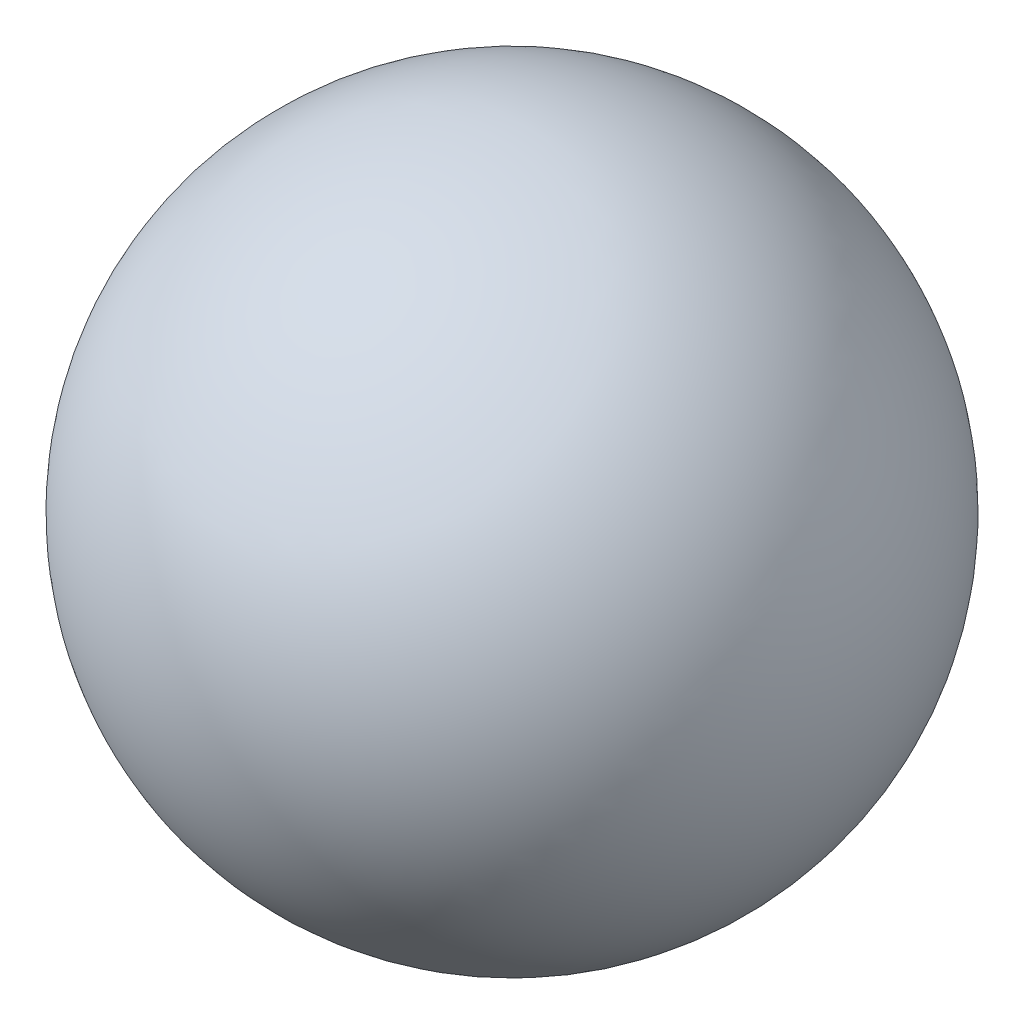
ISO-10303-21;
HEADER;
FILE_DESCRIPTION(('STEP AP214'),'2;1');
FILE_NAME('part.step','',(''),(''),'','','');
FILE_SCHEMA(('AUTOMOTIVE_DESIGN { 1 0 10303 214 1 1 1 1 }'));
ENDSEC;
DATA;
#1=APPLICATION_CONTEXT('core data for automotive mechanical design processes');
#2=APPLICATION_PROTOCOL_DEFINITION('international standard','automotive_design',2000,#1);
#3=PRODUCT_CONTEXT('',#1,'mechanical');
#4=PRODUCT('Part','Part','',(#3));
#5=PRODUCT_RELATED_PRODUCT_CATEGORY('part','',(#4));
#6=PRODUCT_DEFINITION_FORMATION('','',#4);
#7=PRODUCT_DEFINITION_CONTEXT('part definition',#1,'design');
#8=PRODUCT_DEFINITION('design','',#6,#7);
#9=PRODUCT_DEFINITION_SHAPE('','',#8);
#10=(LENGTH_UNIT() NAMED_UNIT(*) SI_UNIT(.MILLI.,.METRE.));
#11=(NAMED_UNIT(*) PLANE_ANGLE_UNIT() SI_UNIT($,.RADIAN.));
#12=(NAMED_UNIT(*) SI_UNIT($,.STERADIAN.) SOLID_ANGLE_UNIT());
#13=UNCERTAINTY_MEASURE_WITH_UNIT(LENGTH_MEASURE(1.E-05),#10,'distance_accuracy_value','');
#14=(GEOMETRIC_REPRESENTATION_CONTEXT(3) GLOBAL_UNCERTAINTY_ASSIGNED_CONTEXT((#13)) GLOBAL_UNIT_ASSIGNED_CONTEXT((#10,
#11,#12)) REPRESENTATION_CONTEXT('',''));
#15=CARTESIAN_POINT('',(0.,0.,0.));
#16=DIRECTION('',(0.,0.,1.));
#17=DIRECTION('',(1.,0.,0.));
#18=AXIS2_PLACEMENT_3D('',#15,#16,#17);
#19=CARTESIAN_POINT('',(11.630401942101,-2.,-1.67219934971108));
#20=DIRECTION('',(0.,0.,1.));
#21=DIRECTION('',(1.,0.,0.));
#22=AXIS2_PLACEMENT_3D('',#19,#20,#21);
#23=SPHERICAL_SURFACE('',#22,1.05);
#24=CARTESIAN_POINT('',(11.630401942101,-2.,-0.62219934971108));
#25=VERTEX_POINT('',#24);
#26=VERTEX_LOOP('',#25);
#27=FACE_BOUND('',#26,.T.);
#28=ADVANCED_FACE('F13',(#27),#23,.T.);
#29=CLOSED_SHELL('',(#28));
#30=MANIFOLD_SOLID_BREP('B1',#29);
#31=ADVANCED_BREP_SHAPE_REPRESENTATION('',(#18,#30),#14);
#32=SHAPE_DEFINITION_REPRESENTATION(#9,#31);
ENDSEC;
END-ISO-10303-21;
